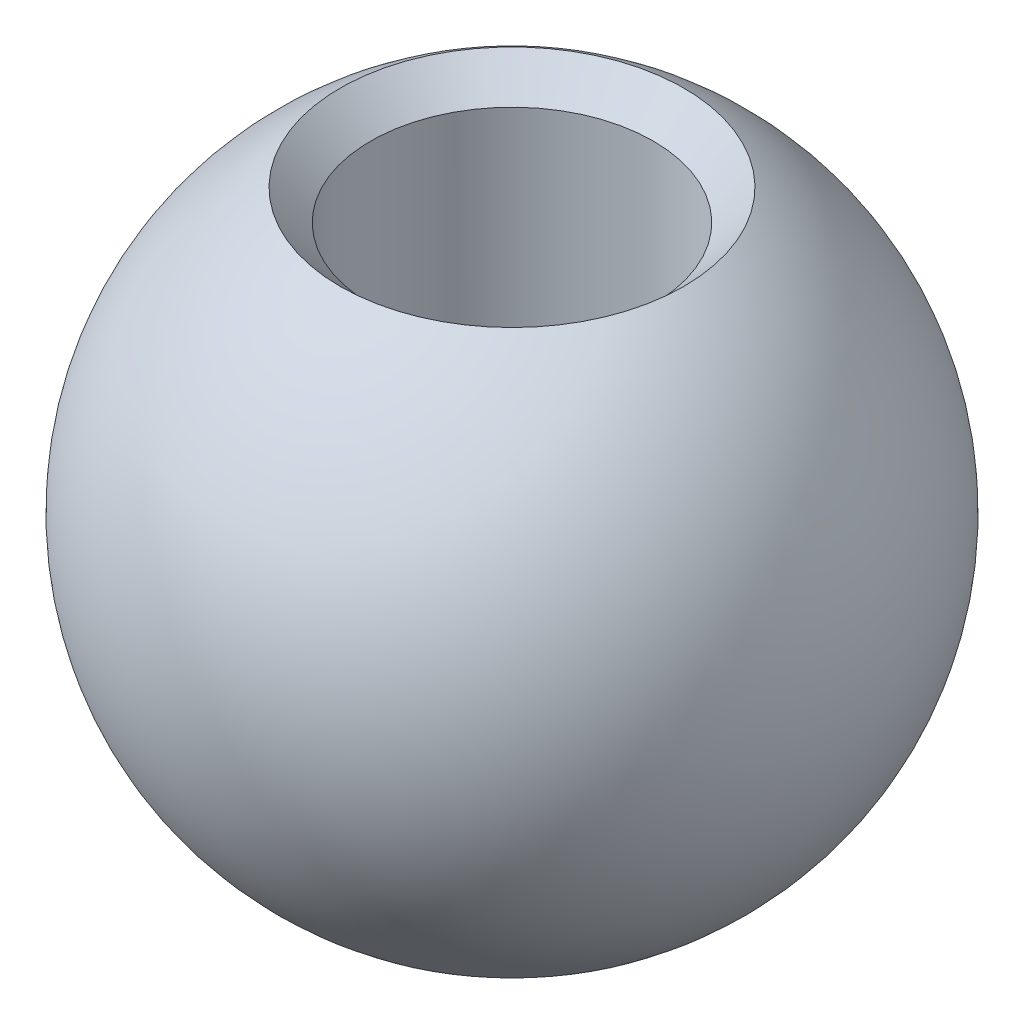
ISO-10303-21;
HEADER;
FILE_DESCRIPTION(('STEP AP214'),'2;1');
FILE_NAME('part.step','',(''),(''),'','','');
FILE_SCHEMA(('AUTOMOTIVE_DESIGN { 1 0 10303 214 1 1 1 1 }'));
ENDSEC;
DATA;
#1=APPLICATION_CONTEXT('core data for automotive mechanical design processes');
#2=APPLICATION_PROTOCOL_DEFINITION('international standard','automotive_design',2000,#1);
#3=PRODUCT_CONTEXT('',#1,'mechanical');
#4=PRODUCT('Part','Part','',(#3));
#5=PRODUCT_RELATED_PRODUCT_CATEGORY('part','',(#4));
#6=PRODUCT_DEFINITION_FORMATION('','',#4);
#7=PRODUCT_DEFINITION_CONTEXT('part definition',#1,'design');
#8=PRODUCT_DEFINITION('design','',#6,#7);
#9=PRODUCT_DEFINITION_SHAPE('','',#8);
#10=(LENGTH_UNIT() NAMED_UNIT(*) SI_UNIT(.MILLI.,.METRE.));
#11=(NAMED_UNIT(*) PLANE_ANGLE_UNIT() SI_UNIT($,.RADIAN.));
#12=(NAMED_UNIT(*) SI_UNIT($,.STERADIAN.) SOLID_ANGLE_UNIT());
#13=UNCERTAINTY_MEASURE_WITH_UNIT(LENGTH_MEASURE(1.E-05),#10,'distance_accuracy_value','');
#14=(GEOMETRIC_REPRESENTATION_CONTEXT(3) GLOBAL_UNCERTAINTY_ASSIGNED_CONTEXT((#13)) GLOBAL_UNIT_ASSIGNED_CONTEXT((#10,
#11,#12)) REPRESENTATION_CONTEXT('',''));
#15=CARTESIAN_POINT('',(0.,0.,0.));
#16=DIRECTION('',(0.,0.,1.));
#17=DIRECTION('',(1.,0.,0.));
#18=AXIS2_PLACEMENT_3D('',#15,#16,#17);
#19=CARTESIAN_POINT('',(0.,0.,0.));
#20=DIRECTION('',(0.,-1.,0.));
#21=DIRECTION('',(0.,0.,-1.));
#22=AXIS2_PLACEMENT_3D('',#19,#20,#21);
#23=CYLINDRICAL_SURFACE('',#22,3.);
#24=CARTESIAN_POINT('',(0.,-5.57384928026072,0.));
#25=DIRECTION('',(0.,-1.,0.));
#26=DIRECTION('',(0.,0.,-1.));
#27=AXIS2_PLACEMENT_3D('',#24,#25,#26);
#28=CIRCLE('',#27,3.);
#29=CARTESIAN_POINT('',(0.,-5.57384928026072,-3.));
#30=VERTEX_POINT('',#29);
#31=EDGE_CURVE('E45',#30,#30,#28,.T.);
#32=ORIENTED_EDGE('',*,*,#31,.T.);
#33=EDGE_LOOP('',(#32));
#34=FACE_BOUND('',#33,.T.);
#35=CARTESIAN_POINT('',(0.,5.32455532033675,0.));
#36=DIRECTION('',(0.,1.,0.));
#37=DIRECTION('',(0.,0.,1.));
#38=AXIS2_PLACEMENT_3D('',#35,#36,#37);
#39=CIRCLE('',#38,3.);
#40=CARTESIAN_POINT('',(0.,5.32455532033675,3.));
#41=VERTEX_POINT('',#40);
#42=EDGE_CURVE('E49',#41,#41,#39,.T.);
#43=ORIENTED_EDGE('',*,*,#42,.T.);
#44=EDGE_LOOP('',(#43));
#45=FACE_BOUND('',#44,.T.);
#46=ADVANCED_FACE('F34',(#34,#45),#23,.F.);
#47=CARTESIAN_POINT('',(0.,0.,0.));
#48=DIRECTION('',(0.,-1.,0.));
#49=DIRECTION('',(1.,0.,0.));
#50=AXIS2_PLACEMENT_3D('',#47,#48,#49);
#51=SPHERICAL_SURFACE('',#50,7.);
#52=CARTESIAN_POINT('',(0.,-5.86606476371,0.));
#53=DIRECTION('',(0.,1.,0.));
#54=DIRECTION('',(0.,0.,1.));
#55=AXIS2_PLACEMENT_3D('',#52,#53,#54);
#56=CIRCLE('',#55,3.81959214942642);
#57=CARTESIAN_POINT('',(3.81959214942642,-5.86606476371,0.));
#58=VERTEX_POINT('',#57);
#59=EDGE_CURVE('E10',#58,#58,#56,.T.);
#60=CARTESIAN_POINT('',(0.,5.97362992753288,0.));
#61=DIRECTION('',(0.,-1.,0.));
#62=DIRECTION('',(0.,0.,-1.));
#63=AXIS2_PLACEMENT_3D('',#60,#61,#62);
#64=CIRCLE('',#63,3.64907460719612);
#65=CARTESIAN_POINT('',(3.64907460719612,5.97362992753288,0.));
#66=VERTEX_POINT('',#65);
#67=EDGE_CURVE('E41',#66,#66,#64,.T.);
#68=CARTESIAN_POINT('',(3.81959214942642,-5.86606476371,0.));
#69=CARTESIAN_POINT('',(3.94278659126531,-5.78585657837283,0.));
#70=CARTESIAN_POINT('',(4.06344657863888,-5.70175734005733,0.));
#71=CARTESIAN_POINT('',(4.29923618546931,-5.52613369018018,0.));
#72=CARTESIAN_POINT('',(4.41436580492617,-5.43460927861853,0.));
#73=CARTESIAN_POINT('',(4.63863321693707,-5.24449221495963,0.));
#74=CARTESIAN_POINT('',(4.74777100949111,-5.14589956286238,0.));
#75=CARTESIAN_POINT('',(4.95962296347031,-4.94203889123775,0.));
#76=CARTESIAN_POINT('',(5.06233712489547,-4.83677087171038,0.));
#77=CARTESIAN_POINT('',(5.2609339251536,-4.61997671016039,0.));
#78=CARTESIAN_POINT('',(5.35681656398658,-4.50845056813778,0.));
#79=CARTESIAN_POINT('',(5.54136995648312,-4.27958280486739,0.));
#80=CARTESIAN_POINT('',(5.63004071014669,-4.1622411836196,0.));
#81=CARTESIAN_POINT('',(5.79981847258028,-3.92220802848087,0.));
#82=CARTESIAN_POINT('',(5.88092548135031,-3.79951649458993,0.));
#83=CARTESIAN_POINT('',(6.03525393669168,-3.549270349307,0.));
#84=CARTESIAN_POINT('',(6.10847538326303,-3.42171573791502,0.));
#85=CARTESIAN_POINT('',(6.24674217782601,-3.16224955802611,0.));
#86=CARTESIAN_POINT('',(6.31178752581764,-3.03033798952919,0.));
#87=CARTESIAN_POINT('',(6.43344403087821,-2.76268130667586,0.));
#88=CARTESIAN_POINT('',(6.49005518794715,-2.62693619231946,0.));
#89=CARTESIAN_POINT('',(6.59461868418026,-2.35215103929903,0.));
#90=CARTESIAN_POINT('',(6.64257102334445,-2.213111000635,0.));
#91=CARTESIAN_POINT('',(6.72962661418149,-1.93228769465906,0.));
#92=CARTESIAN_POINT('',(6.76872986585435,-1.79050442734713,0.));
#93=CARTESIAN_POINT('',(6.83793212428839,-1.50475724450912,0.));
#94=CARTESIAN_POINT('',(6.86803113104957,-1.36079332898304,0.));
#95=CARTESIAN_POINT('',(6.91910547010681,-1.07125608273833,0.));
#96=CARTESIAN_POINT('',(6.94008080240287,-0.925682752019703,0.));
#97=CARTESIAN_POINT('',(6.97282456471248,-0.633504294390355,0.));
#98=CARTESIAN_POINT('',(6.98459299472604,-0.486899167479636,0.));
#99=CARTESIAN_POINT('',(6.99887625663197,-0.193238830521694,0.));
#100=CARTESIAN_POINT('',(7.00139108852434,-0.0461836204744709,0.));
#101=CARTESIAN_POINT('',(6.99715717561089,0.247793383820663,0.));
#102=CARTESIAN_POINT('',(6.99040843080506,0.394715178068574,0.));
#103=CARTESIAN_POINT('',(6.96767414277403,0.687842381208521,0.));
#104=CARTESIAN_POINT('',(6.95168859954883,0.834047790100557,0.));
#105=CARTESIAN_POINT('',(6.91054414356021,1.12516209551039,0.));
#106=CARTESIAN_POINT('',(6.88538523079677,1.2700709920282,0.));
#107=CARTESIAN_POINT('',(6.82599386353722,1.55801729009113,0.));
#108=CARTESIAN_POINT('',(6.79176140904111,1.70105469163625,0.));
#109=CARTESIAN_POINT('',(6.71435878893675,1.98469044303796,0.));
#110=CARTESIAN_POINT('',(6.67118862332849,2.12528879289453,0.));
#111=CARTESIAN_POINT('',(6.57608187548807,2.40348856210807,0.));
#112=CARTESIAN_POINT('',(6.52414529325589,2.54108998146503,0.));
#113=CARTESIAN_POINT('',(6.41171179079474,2.81274990230223,0.));
#114=CARTESIAN_POINT('',(6.35121487056577,2.94680840378247,0.));
#115=CARTESIAN_POINT('',(6.22190073737007,3.21085055961264,0.));
#116=CARTESIAN_POINT('',(6.15308352440334,3.34083421396257,0.));
#117=CARTESIAN_POINT('',(6.00740186443939,3.59621091402546,0.));
#118=CARTESIAN_POINT('',(5.93053741744216,3.72160395973842,0.));
#119=CARTESIAN_POINT('',(5.7690662807571,3.96730189903513,0.));
#120=CARTESIAN_POINT('',(5.68445959106926,4.08760679261888,0.));
#121=CARTESIAN_POINT('',(5.50783967290823,4.32265106226102,0.));
#122=CARTESIAN_POINT('',(5.41582644443505,4.43739043831939,0.));
#123=CARTESIAN_POINT('',(5.22475857006655,4.66084843242719,0.));
#124=CARTESIAN_POINT('',(5.12570392417124,4.76956705047661,0.));
#125=CARTESIAN_POINT('',(4.92094616719802,4.98055202272399,0.));
#126=CARTESIAN_POINT('',(4.81524305612012,5.08281837692195,0.));
#127=CARTESIAN_POINT('',(4.59760810705785,5.28049349621296,0.));
#128=CARTESIAN_POINT('',(4.48567626907349,5.37590226130601,0.));
#129=CARTESIAN_POINT('',(4.25602680544922,5.55948192750419,0.));
#130=CARTESIAN_POINT('',(4.13830917980933,5.64765282860933,0.));
#131=CARTESIAN_POINT('',(3.89755968755919,5.81641327144686,0.));
#132=CARTESIAN_POINT('',(3.77452782094894,5.89700281317926,0.));
#133=CARTESIAN_POINT('',(3.64907460719612,5.97362992753288,0.));
#134=B_SPLINE_CURVE_WITH_KNOTS('',3,(#68,#69,#70,#71,#72,#73,#74,#75,#76,#77,#78,#79,#80,#81,
#82,#83,#84,#85,#86,#87,#88,#89,#90,#91,#92,#93,#94,#95,#96,#97,#98,#99,#100,#101,#102,#103,
#104,#105,#106,#107,#108,#109,#110,#111,#112,#113,#114,#115,#116,#117,#118,#119,#120,#121,#122,
#123,#124,#125,#126,#127,#128,#129,#130,#131,#132,#133),.UNSPECIFIED.,.F.,.F.,(4,2,2,2,2,2,2,2,
2,2,2,2,2,2,2,2,2,2,2,2,2,2,2,2,2,2,2,2,2,2,2,2,4),(0.,0.440938343554884,0.881876687109769,
1.32281503066465,1.76375337421954,2.20469171777442,2.64563006132931,3.08656840488419,
3.52750674843908,3.96844509199396,4.40938343554885,4.85032177910373,5.29126012265862,
5.7321984662135,6.17313680976839,6.61407515332327,7.05501349687815,7.49595184043304,
7.93689018398792,8.37782852754281,8.81876687109769,9.25970521465258,9.70064355820746,
10.1415819017623,10.5825202453172,11.0234585888721,11.464396932427,11.9053352759819,
12.3462736195368,12.7872119630917,13.2281503066465,13.6690886502014,14.1100269937563),.UNSPECIFIED.);
#135=EDGE_CURVE('BSEAM62',#58,#66,#134,.T.);
#136=ORIENTED_EDGE('',*,*,#59,.T.);
#137=ORIENTED_EDGE('',*,*,#67,.T.);
#138=ORIENTED_EDGE('',*,*,#135,.T.);
#139=ORIENTED_EDGE('',*,*,#135,.F.);
#140=EDGE_LOOP('',(#136,#138,#137,#139));
#141=FACE_BOUND('',#140,.T.);
#142=ADVANCED_FACE('F62',(#141),#51,.T.);
#143=CARTESIAN_POINT('',(0.,-5.57384928026072,0.));
#144=DIRECTION('',(0.,-1.,0.));
#145=DIRECTION('',(0.,0.,-1.));
#146=AXIS2_PLACEMENT_3D('',#143,#144,#145);
#147=CONICAL_SURFACE('',#146,3.,1.2283092074711);
#148=ORIENTED_EDGE('',*,*,#59,.F.);
#149=EDGE_LOOP('',(#148));
#150=FACE_BOUND('',#149,.T.);
#151=ORIENTED_EDGE('',*,*,#31,.F.);
#152=EDGE_LOOP('',(#151));
#153=FACE_BOUND('',#152,.T.);
#154=ADVANCED_FACE('F58',(#150,#153),#147,.F.);
#155=CARTESIAN_POINT('',(0.,5.97362992753288,0.));
#156=DIRECTION('',(0.,1.,0.));
#157=DIRECTION('',(0.,0.,1.));
#158=AXIS2_PLACEMENT_3D('',#155,#156,#157);
#159=CONICAL_SURFACE('',#158,3.64907460719612,0.785398163397445);
#160=ORIENTED_EDGE('',*,*,#42,.F.);
#161=EDGE_LOOP('',(#160));
#162=FACE_BOUND('',#161,.T.);
#163=ORIENTED_EDGE('',*,*,#67,.F.);
#164=EDGE_LOOP('',(#163));
#165=FACE_BOUND('',#164,.T.);
#166=ADVANCED_FACE('F36',(#162,#165),#159,.F.);
#167=CLOSED_SHELL('',(#46,#142,#154,#166));
#168=MANIFOLD_SOLID_BREP('B2',#167);
#169=ADVANCED_BREP_SHAPE_REPRESENTATION('',(#18,#168),#14);
#170=SHAPE_DEFINITION_REPRESENTATION(#9,#169);
ENDSEC;
END-ISO-10303-21;
